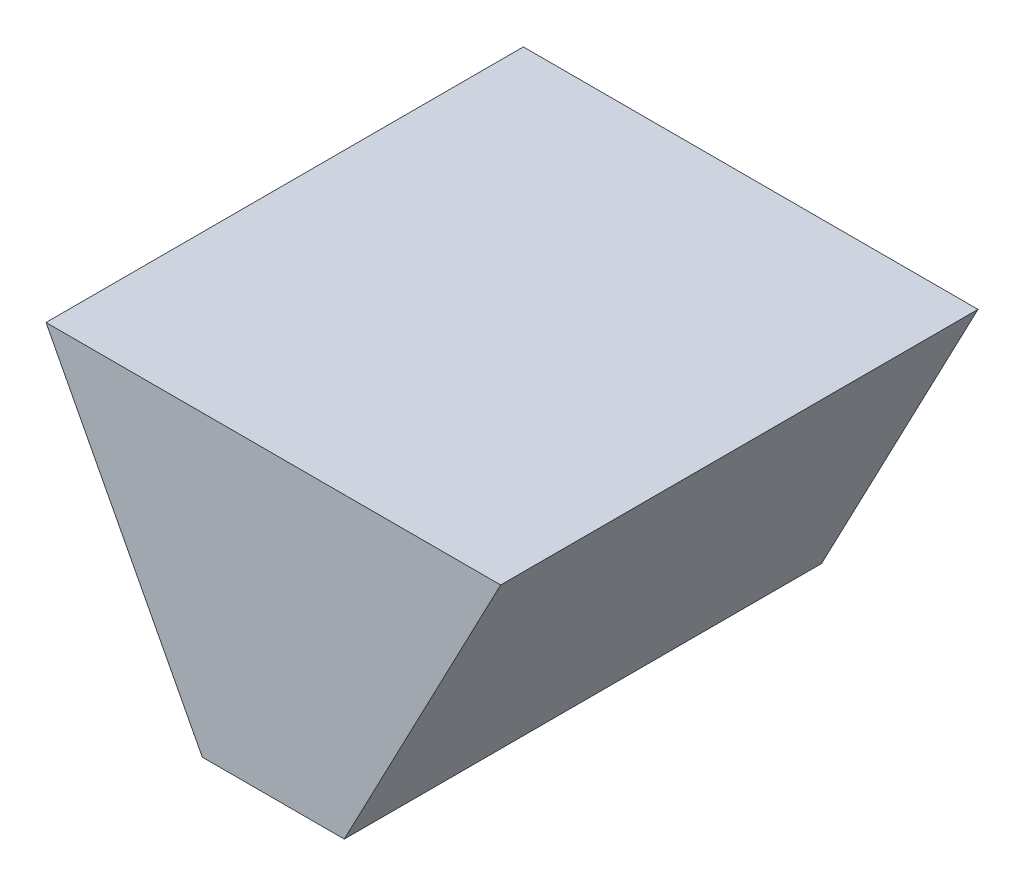
ISO-10303-21;
HEADER;
FILE_DESCRIPTION(('STEP AP214'),'2;1');
FILE_NAME('part.step','',(''),(''),'','','');
FILE_SCHEMA(('AUTOMOTIVE_DESIGN { 1 0 10303 214 1 1 1 1 }'));
ENDSEC;
DATA;
#1=APPLICATION_CONTEXT('core data for automotive mechanical design processes');
#2=APPLICATION_PROTOCOL_DEFINITION('international standard','automotive_design',2000,#1);
#3=PRODUCT_CONTEXT('',#1,'mechanical');
#4=PRODUCT('Part','Part','',(#3));
#5=PRODUCT_RELATED_PRODUCT_CATEGORY('part','',(#4));
#6=PRODUCT_DEFINITION_FORMATION('','',#4);
#7=PRODUCT_DEFINITION_CONTEXT('part definition',#1,'design');
#8=PRODUCT_DEFINITION('design','',#6,#7);
#9=PRODUCT_DEFINITION_SHAPE('','',#8);
#10=(LENGTH_UNIT() NAMED_UNIT(*) SI_UNIT(.MILLI.,.METRE.));
#11=(NAMED_UNIT(*) PLANE_ANGLE_UNIT() SI_UNIT($,.RADIAN.));
#12=(NAMED_UNIT(*) SI_UNIT($,.STERADIAN.) SOLID_ANGLE_UNIT());
#13=UNCERTAINTY_MEASURE_WITH_UNIT(LENGTH_MEASURE(1.E-05),#10,'distance_accuracy_value','');
#14=(GEOMETRIC_REPRESENTATION_CONTEXT(3) GLOBAL_UNCERTAINTY_ASSIGNED_CONTEXT((#13)) GLOBAL_UNIT_ASSIGNED_CONTEXT((#10,
#11,#12)) REPRESENTATION_CONTEXT('',''));
#15=CARTESIAN_POINT('',(0.,0.,0.));
#16=DIRECTION('',(0.,0.,1.));
#17=DIRECTION('',(1.,0.,0.));
#18=AXIS2_PLACEMENT_3D('',#15,#16,#17);
#19=CARTESIAN_POINT('',(0.1905,0.12498832,0.3999992));
#20=DIRECTION('',(0.,0.,1.));
#21=DIRECTION('',(1.,0.,0.));
#22=AXIS2_PLACEMENT_3D('',#19,#20,#21);
#23=PLANE('',#22);
#24=DIRECTION('',(1.,0.,0.));
#25=VECTOR('',#24,1.);
#26=CARTESIAN_POINT('',(-0.1905,0.12498832,0.3999992));
#27=LINE('',#26,#25);
#28=CARTESIAN_POINT('',(-0.1905,0.12498832,0.3999992));
#29=VERTEX_POINT('',#28);
#30=CARTESIAN_POINT('',(0.1905,0.12498832,0.3999992));
#31=VERTEX_POINT('',#30);
#32=EDGE_CURVE('E25',#29,#31,#27,.T.);
#33=ORIENTED_EDGE('',*,*,#32,.F.);
#34=DIRECTION('',(-0.464111247999921,0.88577691857485,0.));
#35=VECTOR('',#34,1.);
#36=CARTESIAN_POINT('',(-0.05952235999996,-0.12498832,0.3999992));
#37=LINE('',#36,#35);
#38=CARTESIAN_POINT('',(-0.05952235999996,-0.12498832,0.3999992));
#39=VERTEX_POINT('',#38);
#40=EDGE_CURVE('E106',#39,#29,#37,.T.);
#41=ORIENTED_EDGE('',*,*,#40,.F.);
#42=DIRECTION('',(-0.999999981541233,-0.000192139361073544,0.));
#43=VECTOR('',#42,1.);
#44=CARTESIAN_POINT('',(0.05945378000001,-0.12496546,0.3999992));
#45=LINE('',#44,#43);
#46=CARTESIAN_POINT('',(0.05945378000001,-0.12496546,0.3999992));
#47=VERTEX_POINT('',#46);
#48=EDGE_CURVE('E83',#47,#39,#45,.T.);
#49=ORIENTED_EDGE('',*,*,#48,.F.);
#50=DIRECTION('',(-0.464335189296182,-0.885659546316348,0.));
#51=VECTOR('',#50,1.);
#52=CARTESIAN_POINT('',(0.1905,0.12498832,0.3999992));
#53=LINE('',#52,#51);
#54=EDGE_CURVE('E87',#31,#47,#53,.T.);
#55=ORIENTED_EDGE('',*,*,#54,.F.);
#56=EDGE_LOOP('',(#33,#41,#49,#55));
#57=FACE_BOUND('',#56,.T.);
#58=ADVANCED_FACE('F17',(#57),#23,.T.);
#59=CARTESIAN_POINT('',(0.1905,0.12498832,0.));
#60=DIRECTION('',(0.,0.,1.));
#61=DIRECTION('',(1.,0.,0.));
#62=AXIS2_PLACEMENT_3D('',#59,#60,#61);
#63=PLANE('',#62);
#64=DIRECTION('',(-0.464335189296182,-0.885659546316348,0.));
#65=VECTOR('',#64,1.);
#66=CARTESIAN_POINT('',(0.1905,0.12498832,0.));
#67=LINE('',#66,#65);
#68=CARTESIAN_POINT('',(0.1905,0.12498832,0.));
#69=VERTEX_POINT('',#68);
#70=CARTESIAN_POINT('',(0.05945378000001,-0.12496546,0.));
#71=VERTEX_POINT('',#70);
#72=EDGE_CURVE('E71',#69,#71,#67,.T.);
#73=ORIENTED_EDGE('',*,*,#72,.T.);
#74=DIRECTION('',(-0.999999981541233,-0.000192139361073544,0.));
#75=VECTOR('',#74,1.);
#76=CARTESIAN_POINT('',(0.05945378000001,-0.12496546,0.));
#77=LINE('',#76,#75);
#78=CARTESIAN_POINT('',(-0.05952235999996,-0.12498832,0.));
#79=VERTEX_POINT('',#78);
#80=EDGE_CURVE('E103',#71,#79,#77,.T.);
#81=ORIENTED_EDGE('',*,*,#80,.T.);
#82=DIRECTION('',(-0.464111247999921,0.88577691857485,0.));
#83=VECTOR('',#82,1.);
#84=CARTESIAN_POINT('',(-0.05952235999996,-0.12498832,0.));
#85=LINE('',#84,#83);
#86=CARTESIAN_POINT('',(-0.1905,0.12498832,0.));
#87=VERTEX_POINT('',#86);
#88=EDGE_CURVE('E73',#79,#87,#85,.T.);
#89=ORIENTED_EDGE('',*,*,#88,.T.);
#90=DIRECTION('',(1.,0.,0.));
#91=VECTOR('',#90,1.);
#92=CARTESIAN_POINT('',(-0.1905,0.12498832,0.));
#93=LINE('',#92,#91);
#94=EDGE_CURVE('E11',#87,#69,#93,.T.);
#95=ORIENTED_EDGE('',*,*,#94,.T.);
#96=EDGE_LOOP('',(#73,#81,#89,#95));
#97=FACE_BOUND('',#96,.T.);
#98=ADVANCED_FACE('F69',(#97),#63,.F.);
#99=CARTESIAN_POINT('',(-0.1905,0.12498832,0.));
#100=DIRECTION('',(0.,1.,0.));
#101=DIRECTION('',(1.,0.,0.));
#102=AXIS2_PLACEMENT_3D('',#99,#100,#101);
#103=PLANE('',#102);
#104=DIRECTION('',(0.,0.,1.));
#105=VECTOR('',#104,1.);
#106=CARTESIAN_POINT('',(-0.1905,0.12498832,0.));
#107=LINE('',#106,#105);
#108=EDGE_CURVE('E109',#87,#29,#107,.T.);
#109=ORIENTED_EDGE('',*,*,#108,.T.);
#110=ORIENTED_EDGE('',*,*,#32,.T.);
#111=DIRECTION('',(0.,0.,1.));
#112=VECTOR('',#111,1.);
#113=CARTESIAN_POINT('',(0.1905,0.12498832,0.));
#114=LINE('',#113,#112);
#115=EDGE_CURVE('E79',#69,#31,#114,.T.);
#116=ORIENTED_EDGE('',*,*,#115,.F.);
#117=ORIENTED_EDGE('',*,*,#94,.F.);
#118=EDGE_LOOP('',(#109,#110,#116,#117));
#119=FACE_BOUND('',#118,.T.);
#120=ADVANCED_FACE('F85',(#119),#103,.T.);
#121=CARTESIAN_POINT('',(-0.05952235999996,-0.12498832,0.));
#122=DIRECTION('',(-0.88577691857485,-0.464111247999921,0.));
#123=DIRECTION('',(-0.464111247999921,0.88577691857485,0.));
#124=AXIS2_PLACEMENT_3D('',#121,#122,#123);
#125=PLANE('',#124);
#126=DIRECTION('',(0.,0.,1.));
#127=VECTOR('',#126,1.);
#128=CARTESIAN_POINT('',(-0.05952235999996,-0.12498832,0.));
#129=LINE('',#128,#127);
#130=EDGE_CURVE('E99',#79,#39,#129,.T.);
#131=ORIENTED_EDGE('',*,*,#130,.T.);
#132=ORIENTED_EDGE('',*,*,#40,.T.);
#133=ORIENTED_EDGE('',*,*,#108,.F.);
#134=ORIENTED_EDGE('',*,*,#88,.F.);
#135=EDGE_LOOP('',(#131,#132,#133,#134));
#136=FACE_BOUND('',#135,.T.);
#137=ADVANCED_FACE('F154',(#136),#125,.T.);
#138=CARTESIAN_POINT('',(0.05945378000001,-0.12496546,0.));
#139=DIRECTION('',(0.000192139361073544,-0.999999981541233,0.));
#140=DIRECTION('',(0.,0.,-1.));
#141=AXIS2_PLACEMENT_3D('',#138,#139,#140);
#142=PLANE('',#141);
#143=DIRECTION('',(0.,0.,1.));
#144=VECTOR('',#143,1.);
#145=CARTESIAN_POINT('',(0.05945378000001,-0.12496546,0.));
#146=LINE('',#145,#144);
#147=EDGE_CURVE('E81',#71,#47,#146,.T.);
#148=ORIENTED_EDGE('',*,*,#147,.T.);
#149=ORIENTED_EDGE('',*,*,#48,.T.);
#150=ORIENTED_EDGE('',*,*,#130,.F.);
#151=ORIENTED_EDGE('',*,*,#80,.F.);
#152=EDGE_LOOP('',(#148,#149,#150,#151));
#153=FACE_BOUND('',#152,.T.);
#154=ADVANCED_FACE('F151',(#153),#142,.T.);
#155=CARTESIAN_POINT('',(0.1905,0.12498832,0.));
#156=DIRECTION('',(0.885659546316348,-0.464335189296182,0.));
#157=DIRECTION('',(0.,0.,-1.));
#158=AXIS2_PLACEMENT_3D('',#155,#156,#157);
#159=PLANE('',#158);
#160=ORIENTED_EDGE('',*,*,#115,.T.);
#161=ORIENTED_EDGE('',*,*,#54,.T.);
#162=ORIENTED_EDGE('',*,*,#147,.F.);
#163=ORIENTED_EDGE('',*,*,#72,.F.);
#164=EDGE_LOOP('',(#160,#161,#162,#163));
#165=FACE_BOUND('',#164,.T.);
#166=ADVANCED_FACE('F77',(#165),#159,.T.);
#167=CLOSED_SHELL('',(#58,#98,#120,#137,#154,#166));
#168=MANIFOLD_SOLID_BREP('B1',#167);
#169=ADVANCED_BREP_SHAPE_REPRESENTATION('',(#18,#168),#14);
#170=SHAPE_DEFINITION_REPRESENTATION(#9,#169);
ENDSEC;
END-ISO-10303-21;
